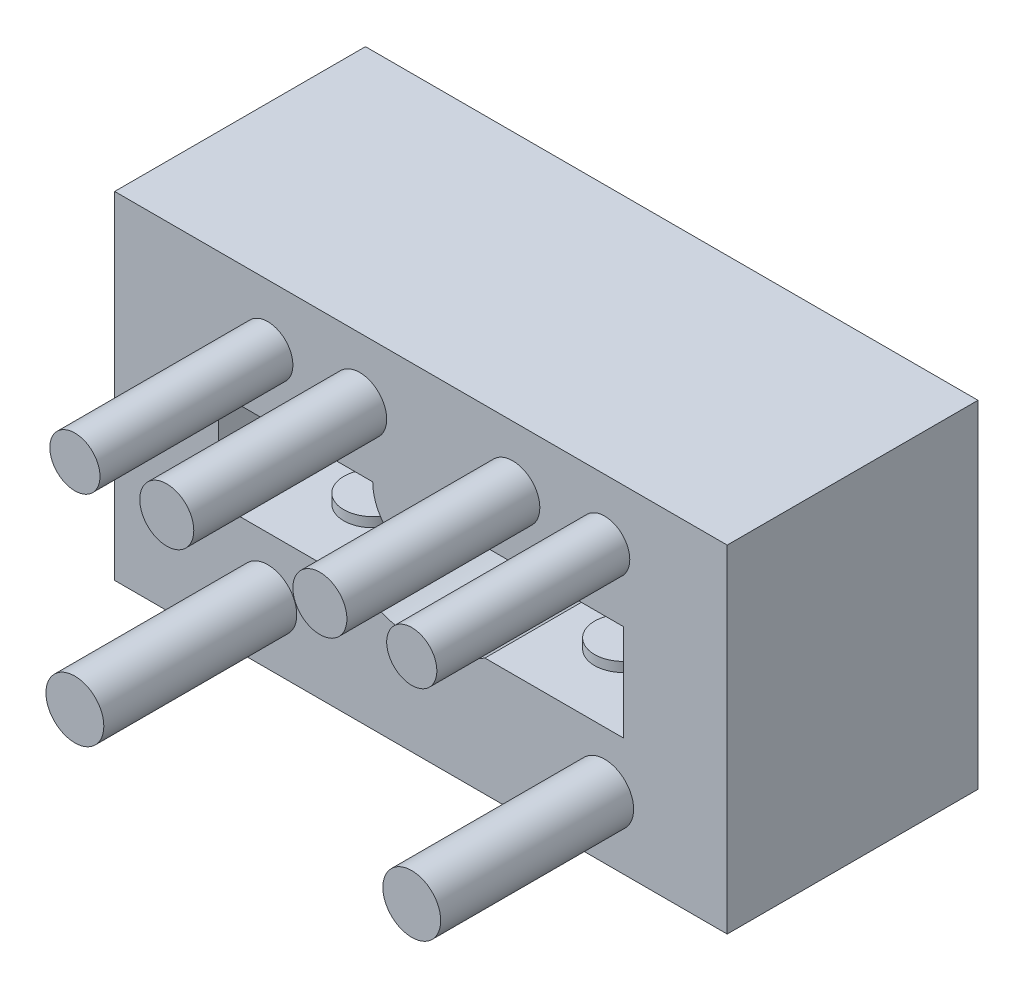
ISO-10303-21;
HEADER;
FILE_DESCRIPTION(('STEP AP214'),'2;1');
FILE_NAME('part.step','',(''),(''),'','','');
FILE_SCHEMA(('AUTOMOTIVE_DESIGN { 1 0 10303 214 1 1 1 1 }'));
ENDSEC;
DATA;
#1=APPLICATION_CONTEXT('core data for automotive mechanical design processes');
#2=APPLICATION_PROTOCOL_DEFINITION('international standard','automotive_design',2000,#1);
#3=PRODUCT_CONTEXT('',#1,'mechanical');
#4=PRODUCT('Part','Part','',(#3));
#5=PRODUCT_RELATED_PRODUCT_CATEGORY('part','',(#4));
#6=PRODUCT_DEFINITION_FORMATION('','',#4);
#7=PRODUCT_DEFINITION_CONTEXT('part definition',#1,'design');
#8=PRODUCT_DEFINITION('design','',#6,#7);
#9=PRODUCT_DEFINITION_SHAPE('','',#8);
#10=(LENGTH_UNIT() NAMED_UNIT(*) SI_UNIT(.MILLI.,.METRE.));
#11=(NAMED_UNIT(*) PLANE_ANGLE_UNIT() SI_UNIT($,.RADIAN.));
#12=(NAMED_UNIT(*) SI_UNIT($,.STERADIAN.) SOLID_ANGLE_UNIT());
#13=UNCERTAINTY_MEASURE_WITH_UNIT(LENGTH_MEASURE(1.E-05),#10,'distance_accuracy_value','');
#14=(GEOMETRIC_REPRESENTATION_CONTEXT(3) GLOBAL_UNCERTAINTY_ASSIGNED_CONTEXT((#13)) GLOBAL_UNIT_ASSIGNED_CONTEXT((#10,
#11,#12)) REPRESENTATION_CONTEXT('',''));
#15=CARTESIAN_POINT('',(0.,0.,0.));
#16=DIRECTION('',(0.,0.,1.));
#17=DIRECTION('',(1.,0.,0.));
#18=AXIS2_PLACEMENT_3D('',#15,#16,#17);
#19=CARTESIAN_POINT('',(3.3166247903554,-5.,13.));
#20=DIRECTION('',(0.,1.,0.));
#21=DIRECTION('',(0.,0.,1.));
#22=AXIS2_PLACEMENT_3D('',#19,#20,#21);
#23=PLANE('',#22);
#24=DIRECTION('',(1.,0.,0.));
#25=VECTOR('',#24,1.);
#26=CARTESIAN_POINT('',(3.3166247903554,-5.,5.));
#27=LINE('',#26,#25);
#28=CARTESIAN_POINT('',(3.3166247903554,-5.,5.));
#29=VERTEX_POINT('',#28);
#30=CARTESIAN_POINT('',(10.5,-5.,5.));
#31=VERTEX_POINT('',#30);
#32=EDGE_CURVE('E174',#29,#31,#27,.T.);
#33=ORIENTED_EDGE('',*,*,#32,.F.);
#34=DIRECTION('',(0.,0.,-1.));
#35=VECTOR('',#34,1.);
#36=CARTESIAN_POINT('',(3.3166247903554,-5.,13.));
#37=LINE('',#36,#35);
#38=CARTESIAN_POINT('',(3.3166247903554,-5.,13.));
#39=VERTEX_POINT('',#38);
#40=EDGE_CURVE('E11',#39,#29,#37,.T.);
#41=ORIENTED_EDGE('',*,*,#40,.F.);
#42=DIRECTION('',(1.,0.,0.));
#43=VECTOR('',#42,1.);
#44=CARTESIAN_POINT('',(3.3166247903554,-5.,13.));
#45=LINE('',#44,#43);
#46=CARTESIAN_POINT('',(10.5,-5.,13.));
#47=VERTEX_POINT('',#46);
#48=EDGE_CURVE('E155',#39,#47,#45,.T.);
#49=ORIENTED_EDGE('',*,*,#48,.T.);
#50=DIRECTION('',(0.,0.,-1.));
#51=VECTOR('',#50,1.);
#52=CARTESIAN_POINT('',(10.5,-5.,13.));
#53=LINE('',#52,#51);
#54=EDGE_CURVE('E39',#47,#31,#53,.T.);
#55=ORIENTED_EDGE('',*,*,#54,.T.);
#56=EDGE_LOOP('',(#33,#41,#49,#55));
#57=FACE_BOUND('',#56,.T.);
#58=CARTESIAN_POINT('',(6.5,-5.,9.));
#59=DIRECTION('',(0.,1.,0.));
#60=DIRECTION('',(0.,0.,1.));
#61=AXIS2_PLACEMENT_3D('',#58,#59,#60);
#62=CIRCLE('',#61,1.5);
#63=CARTESIAN_POINT('',(6.5,-5.,10.5));
#64=VERTEX_POINT('',#63);
#65=EDGE_CURVE('E517',#64,#64,#62,.T.);
#66=ORIENTED_EDGE('',*,*,#65,.F.);
#67=EDGE_LOOP('',(#66));
#68=FACE_BOUND('',#67,.T.);
#69=ADVANCED_FACE('F31',(#57,#68),#23,.T.);
#70=CARTESIAN_POINT('',(-3.3166247903554,-5.,13.));
#71=DIRECTION('',(0.,1.,0.));
#72=DIRECTION('',(0.,0.,1.));
#73=AXIS2_PLACEMENT_3D('',#70,#71,#72);
#74=PLANE('',#73);
#75=DIRECTION('',(1.,0.,0.));
#76=VECTOR('',#75,1.);
#77=CARTESIAN_POINT('',(-3.3166247903554,-5.,5.));
#78=LINE('',#77,#76);
#79=CARTESIAN_POINT('',(-10.5,-5.,5.));
#80=VERTEX_POINT('',#79);
#81=CARTESIAN_POINT('',(-3.3166247903554,-5.,5.));
#82=VERTEX_POINT('',#81);
#83=EDGE_CURVE('E156',#80,#82,#78,.T.);
#84=ORIENTED_EDGE('',*,*,#83,.F.);
#85=DIRECTION('',(0.,0.,-1.));
#86=VECTOR('',#85,1.);
#87=CARTESIAN_POINT('',(-10.5,-5.,13.));
#88=LINE('',#87,#86);
#89=CARTESIAN_POINT('',(-10.5,-5.,13.));
#90=VERTEX_POINT('',#89);
#91=EDGE_CURVE('E190',#90,#80,#88,.T.);
#92=ORIENTED_EDGE('',*,*,#91,.F.);
#93=DIRECTION('',(1.,0.,0.));
#94=VECTOR('',#93,1.);
#95=CARTESIAN_POINT('',(-3.3166247903554,-5.,13.));
#96=LINE('',#95,#94);
#97=CARTESIAN_POINT('',(-3.3166247903554,-5.,13.));
#98=VERTEX_POINT('',#97);
#99=EDGE_CURVE('E169',#90,#98,#96,.T.);
#100=ORIENTED_EDGE('',*,*,#99,.T.);
#101=DIRECTION('',(0.,0.,-1.));
#102=VECTOR('',#101,1.);
#103=CARTESIAN_POINT('',(-3.3166247903554,-5.,13.));
#104=LINE('',#103,#102);
#105=EDGE_CURVE('E171',#98,#82,#104,.T.);
#106=ORIENTED_EDGE('',*,*,#105,.T.);
#107=EDGE_LOOP('',(#84,#92,#100,#106));
#108=FACE_BOUND('',#107,.T.);
#109=CARTESIAN_POINT('',(-6.5,-5.,9.));
#110=DIRECTION('',(0.,1.,0.));
#111=DIRECTION('',(0.,0.,1.));
#112=AXIS2_PLACEMENT_3D('',#109,#110,#111);
#113=CIRCLE('',#112,1.5);
#114=CARTESIAN_POINT('',(-6.5,-5.,10.5));
#115=VERTEX_POINT('',#114);
#116=EDGE_CURVE('E516',#115,#115,#113,.T.);
#117=ORIENTED_EDGE('',*,*,#116,.F.);
#118=EDGE_LOOP('',(#117));
#119=FACE_BOUND('',#118,.T.);
#120=ADVANCED_FACE('F226',(#108,#119),#74,.T.);
#121=CARTESIAN_POINT('',(0.,0.,13.));
#122=DIRECTION('',(0.,0.,1.));
#123=DIRECTION('',(1.,0.,0.));
#124=AXIS2_PLACEMENT_3D('',#121,#122,#123);
#125=PLANE('',#124);
#126=CARTESIAN_POINT('',(-3.175,3.175,13.));
#127=DIRECTION('',(0.,0.,1.));
#128=DIRECTION('',(1.,0.,0.));
#129=AXIS2_PLACEMENT_3D('',#126,#127,#128);
#130=CIRCLE('',#129,1.4);
#131=CARTESIAN_POINT('',(-1.775,3.175,13.));
#132=VERTEX_POINT('',#131);
#133=EDGE_CURVE('E273',#132,#132,#130,.T.);
#134=ORIENTED_EDGE('',*,*,#133,.F.);
#135=EDGE_LOOP('',(#134));
#136=FACE_BOUND('',#135,.T.);
#137=CARTESIAN_POINT('',(-7.9375,-7.9375,13.));
#138=DIRECTION('',(0.,0.,1.));
#139=DIRECTION('',(1.,0.,0.));
#140=AXIS2_PLACEMENT_3D('',#137,#138,#139);
#141=CIRCLE('',#140,1.5);
#142=CARTESIAN_POINT('',(-6.4375,-7.9375,13.));
#143=VERTEX_POINT('',#142);
#144=EDGE_CURVE('E277',#143,#143,#141,.T.);
#145=ORIENTED_EDGE('',*,*,#144,.F.);
#146=EDGE_LOOP('',(#145));
#147=FACE_BOUND('',#146,.T.);
#148=CARTESIAN_POINT('',(9.525,3.175,13.));
#149=DIRECTION('',(0.,0.,1.));
#150=DIRECTION('',(1.,0.,0.));
#151=AXIS2_PLACEMENT_3D('',#148,#149,#150);
#152=CIRCLE('',#151,1.3);
#153=CARTESIAN_POINT('',(10.825,3.175,13.));
#154=VERTEX_POINT('',#153);
#155=EDGE_CURVE('E280',#154,#154,#152,.T.);
#156=ORIENTED_EDGE('',*,*,#155,.F.);
#157=EDGE_LOOP('',(#156));
#158=FACE_BOUND('',#157,.T.);
#159=ORIENTED_EDGE('',*,*,#48,.F.);
#160=CARTESIAN_POINT('',(0.,0.,13.));
#161=DIRECTION('',(0.,0.,1.));
#162=DIRECTION('',(-1.,0.,0.));
#163=AXIS2_PLACEMENT_3D('',#160,#161,#162);
#164=CIRCLE('',#163,6.);
#165=EDGE_CURVE('E153',#98,#39,#164,.T.);
#166=ORIENTED_EDGE('',*,*,#165,.F.);
#167=ORIENTED_EDGE('',*,*,#99,.F.);
#168=DIRECTION('',(0.,-1.,0.));
#169=VECTOR('',#168,1.);
#170=CARTESIAN_POINT('',(-10.5,-5.,13.));
#171=LINE('',#170,#169);
#172=CARTESIAN_POINT('',(-10.5,0.,13.));
#173=VERTEX_POINT('',#172);
#174=EDGE_CURVE('E166',#173,#90,#171,.T.);
#175=ORIENTED_EDGE('',*,*,#174,.F.);
#176=DIRECTION('',(-1.,0.,0.));
#177=VECTOR('',#176,1.);
#178=CARTESIAN_POINT('',(-2.5,0.,13.));
#179=LINE('',#178,#177);
#180=CARTESIAN_POINT('',(-2.5,0.,13.));
#181=VERTEX_POINT('',#180);
#182=EDGE_CURVE('E164',#181,#173,#179,.T.);
#183=ORIENTED_EDGE('',*,*,#182,.F.);
#184=CARTESIAN_POINT('',(0.,0.,13.));
#185=DIRECTION('',(0.,0.,-1.));
#186=DIRECTION('',(-1.,0.,0.));
#187=AXIS2_PLACEMENT_3D('',#184,#185,#186);
#188=CIRCLE('',#187,2.5);
#189=CARTESIAN_POINT('',(2.5,0.,13.));
#190=VERTEX_POINT('',#189);
#191=EDGE_CURVE('E162',#190,#181,#188,.T.);
#192=ORIENTED_EDGE('',*,*,#191,.F.);
#193=DIRECTION('',(-1.,0.,0.));
#194=VECTOR('',#193,1.);
#195=CARTESIAN_POINT('',(2.5,0.,13.));
#196=LINE('',#195,#194);
#197=CARTESIAN_POINT('',(10.5,0.,13.));
#198=VERTEX_POINT('',#197);
#199=EDGE_CURVE('E160',#198,#190,#196,.T.);
#200=ORIENTED_EDGE('',*,*,#199,.F.);
#201=DIRECTION('',(0.,1.,0.));
#202=VECTOR('',#201,1.);
#203=CARTESIAN_POINT('',(10.5,0.,13.));
#204=LINE('',#203,#202);
#205=EDGE_CURVE('E158',#47,#198,#204,.T.);
#206=ORIENTED_EDGE('',*,*,#205,.F.);
#207=EDGE_LOOP('',(#159,#166,#167,#175,#183,#192,#200,#206));
#208=FACE_BOUND('',#207,.T.);
#209=DIRECTION('',(0.,-1.,0.));
#210=VECTOR('',#209,1.);
#211=CARTESIAN_POINT('',(-15.875,-11.1125,13.));
#212=LINE('',#211,#210);
#213=CARTESIAN_POINT('',(-15.875,6.35,13.));
#214=VERTEX_POINT('',#213);
#215=CARTESIAN_POINT('',(-15.875,-11.1125,13.));
#216=VERTEX_POINT('',#215);
#217=EDGE_CURVE('E141',#214,#216,#212,.T.);
#218=ORIENTED_EDGE('',*,*,#217,.T.);
#219=DIRECTION('',(1.,0.,0.));
#220=VECTOR('',#219,1.);
#221=CARTESIAN_POINT('',(15.875,-11.1125,13.));
#222=LINE('',#221,#220);
#223=CARTESIAN_POINT('',(15.875,-11.1125,13.));
#224=VERTEX_POINT('',#223);
#225=EDGE_CURVE('E54',#216,#224,#222,.T.);
#226=ORIENTED_EDGE('',*,*,#225,.T.);
#227=DIRECTION('',(0.,1.,0.));
#228=VECTOR('',#227,1.);
#229=CARTESIAN_POINT('',(15.875,6.35,13.));
#230=LINE('',#229,#228);
#231=CARTESIAN_POINT('',(15.875,6.35,13.));
#232=VERTEX_POINT('',#231);
#233=EDGE_CURVE('E130',#224,#232,#230,.T.);
#234=ORIENTED_EDGE('',*,*,#233,.T.);
#235=DIRECTION('',(-1.,0.,0.));
#236=VECTOR('',#235,1.);
#237=CARTESIAN_POINT('',(-15.875,6.35,13.));
#238=LINE('',#237,#236);
#239=EDGE_CURVE('E136',#232,#214,#238,.T.);
#240=ORIENTED_EDGE('',*,*,#239,.T.);
#241=EDGE_LOOP('',(#218,#226,#234,#240));
#242=FACE_BOUND('',#241,.T.);
#243=CARTESIAN_POINT('',(-7.9375,3.175,13.));
#244=DIRECTION('',(0.,0.,1.));
#245=DIRECTION('',(1.,0.,0.));
#246=AXIS2_PLACEMENT_3D('',#243,#244,#245);
#247=CIRCLE('',#246,1.3);
#248=CARTESIAN_POINT('',(-6.6375,3.175,13.));
#249=VERTEX_POINT('',#248);
#250=EDGE_CURVE('E287',#249,#249,#247,.T.);
#251=ORIENTED_EDGE('',*,*,#250,.F.);
#252=EDGE_LOOP('',(#251));
#253=FACE_BOUND('',#252,.T.);
#254=CARTESIAN_POINT('',(9.525,-7.9375,13.));
#255=DIRECTION('',(0.,0.,1.));
#256=DIRECTION('',(1.,0.,0.));
#257=AXIS2_PLACEMENT_3D('',#254,#255,#256);
#258=CIRCLE('',#257,1.5);
#259=CARTESIAN_POINT('',(11.025,-7.9375,13.));
#260=VERTEX_POINT('',#259);
#261=EDGE_CURVE('E536',#260,#260,#258,.T.);
#262=ORIENTED_EDGE('',*,*,#261,.F.);
#263=EDGE_LOOP('',(#262));
#264=FACE_BOUND('',#263,.T.);
#265=CARTESIAN_POINT('',(4.7625,3.175,13.));
#266=DIRECTION('',(0.,0.,1.));
#267=DIRECTION('',(1.,0.,0.));
#268=AXIS2_PLACEMENT_3D('',#265,#266,#267);
#269=CIRCLE('',#268,1.4);
#270=CARTESIAN_POINT('',(6.1625,3.175,13.));
#271=VERTEX_POINT('',#270);
#272=EDGE_CURVE('E526',#271,#271,#269,.T.);
#273=ORIENTED_EDGE('',*,*,#272,.F.);
#274=EDGE_LOOP('',(#273));
#275=FACE_BOUND('',#274,.T.);
#276=ADVANCED_FACE('F139',(#136,#147,#158,#208,#242,#253,#264,#275),#125,.T.);
#277=CARTESIAN_POINT('',(0.,0.,13.));
#278=DIRECTION('',(0.,0.,-1.));
#279=DIRECTION('',(-1.,0.,0.));
#280=AXIS2_PLACEMENT_3D('',#277,#278,#279);
#281=CYLINDRICAL_SURFACE('',#280,6.);
#282=CARTESIAN_POINT('',(0.,0.,5.));
#283=DIRECTION('',(0.,0.,1.));
#284=DIRECTION('',(-1.,0.,0.));
#285=AXIS2_PLACEMENT_3D('',#282,#283,#284);
#286=CIRCLE('',#285,6.);
#287=EDGE_CURVE('E172',#82,#29,#286,.T.);
#288=ORIENTED_EDGE('',*,*,#287,.F.);
#289=ORIENTED_EDGE('',*,*,#105,.F.);
#290=ORIENTED_EDGE('',*,*,#165,.T.);
#291=ORIENTED_EDGE('',*,*,#40,.T.);
#292=EDGE_LOOP('',(#288,#289,#290,#291));
#293=FACE_BOUND('',#292,.T.);
#294=ADVANCED_FACE('F223',(#293),#281,.F.);
#295=CARTESIAN_POINT('',(10.5,0.,13.));
#296=DIRECTION('',(-1.,0.,0.));
#297=DIRECTION('',(0.,0.,1.));
#298=AXIS2_PLACEMENT_3D('',#295,#296,#297);
#299=PLANE('',#298);
#300=DIRECTION('',(0.,1.,0.));
#301=VECTOR('',#300,1.);
#302=CARTESIAN_POINT('',(10.5,0.,5.));
#303=LINE('',#302,#301);
#304=CARTESIAN_POINT('',(10.5,0.,5.));
#305=VERTEX_POINT('',#304);
#306=EDGE_CURVE('E177',#31,#305,#303,.T.);
#307=ORIENTED_EDGE('',*,*,#306,.F.);
#308=ORIENTED_EDGE('',*,*,#54,.F.);
#309=ORIENTED_EDGE('',*,*,#205,.T.);
#310=DIRECTION('',(0.,0.,-1.));
#311=VECTOR('',#310,1.);
#312=CARTESIAN_POINT('',(10.5,0.,13.));
#313=LINE('',#312,#311);
#314=EDGE_CURVE('E202',#198,#305,#313,.T.);
#315=ORIENTED_EDGE('',*,*,#314,.T.);
#316=EDGE_LOOP('',(#307,#308,#309,#315));
#317=FACE_BOUND('',#316,.T.);
#318=ADVANCED_FACE('F214',(#317),#299,.T.);
#319=CARTESIAN_POINT('',(2.5,0.,13.));
#320=DIRECTION('',(0.,-1.,0.));
#321=DIRECTION('',(0.,0.,-1.));
#322=AXIS2_PLACEMENT_3D('',#319,#320,#321);
#323=PLANE('',#322);
#324=DIRECTION('',(-1.,0.,0.));
#325=VECTOR('',#324,1.);
#326=CARTESIAN_POINT('',(2.5,0.,5.));
#327=LINE('',#326,#325);
#328=CARTESIAN_POINT('',(2.5,0.,5.));
#329=VERTEX_POINT('',#328);
#330=EDGE_CURVE('E179',#305,#329,#327,.T.);
#331=ORIENTED_EDGE('',*,*,#330,.F.);
#332=ORIENTED_EDGE('',*,*,#314,.F.);
#333=ORIENTED_EDGE('',*,*,#199,.T.);
#334=DIRECTION('',(0.,0.,-1.));
#335=VECTOR('',#334,1.);
#336=CARTESIAN_POINT('',(2.5,0.,13.));
#337=LINE('',#336,#335);
#338=EDGE_CURVE('E199',#190,#329,#337,.T.);
#339=ORIENTED_EDGE('',*,*,#338,.T.);
#340=EDGE_LOOP('',(#331,#332,#333,#339));
#341=FACE_BOUND('',#340,.T.);
#342=ADVANCED_FACE('F235',(#341),#323,.T.);
#343=CARTESIAN_POINT('',(0.,0.,13.));
#344=DIRECTION('',(0.,0.,-1.));
#345=DIRECTION('',(-1.,0.,0.));
#346=AXIS2_PLACEMENT_3D('',#343,#344,#345);
#347=CYLINDRICAL_SURFACE('',#346,2.5);
#348=CARTESIAN_POINT('',(0.,0.,5.));
#349=DIRECTION('',(0.,0.,-1.));
#350=DIRECTION('',(-1.,0.,0.));
#351=AXIS2_PLACEMENT_3D('',#348,#349,#350);
#352=CIRCLE('',#351,2.5);
#353=CARTESIAN_POINT('',(-2.5,0.,5.));
#354=VERTEX_POINT('',#353);
#355=EDGE_CURVE('E181',#329,#354,#352,.T.);
#356=ORIENTED_EDGE('',*,*,#355,.F.);
#357=ORIENTED_EDGE('',*,*,#338,.F.);
#358=ORIENTED_EDGE('',*,*,#191,.T.);
#359=DIRECTION('',(0.,0.,-1.));
#360=VECTOR('',#359,1.);
#361=CARTESIAN_POINT('',(-2.5,0.,13.));
#362=LINE('',#361,#360);
#363=EDGE_CURVE('E196',#181,#354,#362,.T.);
#364=ORIENTED_EDGE('',*,*,#363,.T.);
#365=EDGE_LOOP('',(#356,#357,#358,#364));
#366=FACE_BOUND('',#365,.T.);
#367=ADVANCED_FACE('F239',(#366),#347,.T.);
#368=CARTESIAN_POINT('',(-2.5,0.,13.));
#369=DIRECTION('',(0.,-1.,0.));
#370=DIRECTION('',(1.,0.,0.));
#371=AXIS2_PLACEMENT_3D('',#368,#369,#370);
#372=PLANE('',#371);
#373=DIRECTION('',(-1.,0.,0.));
#374=VECTOR('',#373,1.);
#375=CARTESIAN_POINT('',(-2.5,0.,5.));
#376=LINE('',#375,#374);
#377=CARTESIAN_POINT('',(-10.5,0.,5.));
#378=VERTEX_POINT('',#377);
#379=EDGE_CURVE('E183',#354,#378,#376,.T.);
#380=ORIENTED_EDGE('',*,*,#379,.F.);
#381=ORIENTED_EDGE('',*,*,#363,.F.);
#382=ORIENTED_EDGE('',*,*,#182,.T.);
#383=DIRECTION('',(0.,0.,-1.));
#384=VECTOR('',#383,1.);
#385=CARTESIAN_POINT('',(-10.5,0.,13.));
#386=LINE('',#385,#384);
#387=EDGE_CURVE('E193',#173,#378,#386,.T.);
#388=ORIENTED_EDGE('',*,*,#387,.T.);
#389=EDGE_LOOP('',(#380,#381,#382,#388));
#390=FACE_BOUND('',#389,.T.);
#391=ADVANCED_FACE('F245',(#390),#372,.T.);
#392=CARTESIAN_POINT('',(-10.5,-5.,13.));
#393=DIRECTION('',(1.,0.,0.));
#394=DIRECTION('',(0.,0.,-1.));
#395=AXIS2_PLACEMENT_3D('',#392,#393,#394);
#396=PLANE('',#395);
#397=DIRECTION('',(0.,-1.,0.));
#398=VECTOR('',#397,1.);
#399=CARTESIAN_POINT('',(-10.5,-5.,5.));
#400=LINE('',#399,#398);
#401=EDGE_CURVE('E185',#378,#80,#400,.T.);
#402=ORIENTED_EDGE('',*,*,#401,.F.);
#403=ORIENTED_EDGE('',*,*,#387,.F.);
#404=ORIENTED_EDGE('',*,*,#174,.T.);
#405=ORIENTED_EDGE('',*,*,#91,.T.);
#406=EDGE_LOOP('',(#402,#403,#404,#405));
#407=FACE_BOUND('',#406,.T.);
#408=ADVANCED_FACE('F247',(#407),#396,.T.);
#409=CARTESIAN_POINT('',(0.,0.,5.));
#410=DIRECTION('',(0.,0.,1.));
#411=DIRECTION('',(1.,0.,0.));
#412=AXIS2_PLACEMENT_3D('',#409,#410,#411);
#413=PLANE('',#412);
#414=ORIENTED_EDGE('',*,*,#287,.T.);
#415=ORIENTED_EDGE('',*,*,#32,.T.);
#416=ORIENTED_EDGE('',*,*,#306,.T.);
#417=ORIENTED_EDGE('',*,*,#330,.T.);
#418=ORIENTED_EDGE('',*,*,#355,.T.);
#419=ORIENTED_EDGE('',*,*,#379,.T.);
#420=ORIENTED_EDGE('',*,*,#401,.T.);
#421=ORIENTED_EDGE('',*,*,#83,.T.);
#422=EDGE_LOOP('',(#414,#415,#416,#417,#418,#419,#420,#421));
#423=FACE_BOUND('',#422,.T.);
#424=ADVANCED_FACE('F218',(#423),#413,.T.);
#425=CARTESIAN_POINT('',(15.875,-11.1125,-67.8822509939086));
#426=DIRECTION('',(0.,-1.,0.));
#427=DIRECTION('',(1.,0.,0.));
#428=AXIS2_PLACEMENT_3D('',#425,#426,#427);
#429=PLANE('',#428);
#430=DIRECTION('',(0.,0.,1.));
#431=VECTOR('',#430,1.);
#432=CARTESIAN_POINT('',(15.875,-11.1125,-67.8822509939086));
#433=LINE('',#432,#431);
#434=CARTESIAN_POINT('',(15.875,-11.1125,0.));
#435=VERTEX_POINT('',#434);
#436=EDGE_CURVE('E119',#435,#224,#433,.T.);
#437=ORIENTED_EDGE('',*,*,#436,.T.);
#438=ORIENTED_EDGE('',*,*,#225,.F.);
#439=DIRECTION('',(0.,0.,1.));
#440=VECTOR('',#439,1.);
#441=CARTESIAN_POINT('',(-15.875,-11.1125,-67.8822509939086));
#442=LINE('',#441,#440);
#443=CARTESIAN_POINT('',(-15.875,-11.1125,0.));
#444=VERTEX_POINT('',#443);
#445=EDGE_CURVE('E127',#444,#216,#442,.T.);
#446=ORIENTED_EDGE('',*,*,#445,.F.);
#447=DIRECTION('',(-1.,0.,0.));
#448=VECTOR('',#447,1.);
#449=CARTESIAN_POINT('',(15.875,-11.1125,0.));
#450=LINE('',#449,#448);
#451=EDGE_CURVE('E123',#435,#444,#450,.T.);
#452=ORIENTED_EDGE('',*,*,#451,.F.);
#453=EDGE_LOOP('',(#437,#438,#446,#452));
#454=FACE_BOUND('',#453,.T.);
#455=ADVANCED_FACE('F121',(#454),#429,.T.);
#456=CARTESIAN_POINT('',(15.875,6.35,-67.8822509939086));
#457=DIRECTION('',(1.,0.,0.));
#458=DIRECTION('',(0.,0.,-1.));
#459=AXIS2_PLACEMENT_3D('',#456,#457,#458);
#460=PLANE('',#459);
#461=DIRECTION('',(0.,0.,1.));
#462=VECTOR('',#461,1.);
#463=CARTESIAN_POINT('',(15.875,6.35,-67.8822509939086));
#464=LINE('',#463,#462);
#465=CARTESIAN_POINT('',(15.875,6.35,0.));
#466=VERTEX_POINT('',#465);
#467=EDGE_CURVE('E126',#466,#232,#464,.T.);
#468=ORIENTED_EDGE('',*,*,#467,.T.);
#469=ORIENTED_EDGE('',*,*,#233,.F.);
#470=ORIENTED_EDGE('',*,*,#436,.F.);
#471=DIRECTION('',(0.,-1.,0.));
#472=VECTOR('',#471,1.);
#473=CARTESIAN_POINT('',(15.875,6.35,0.));
#474=LINE('',#473,#472);
#475=EDGE_CURVE('E175',#466,#435,#474,.T.);
#476=ORIENTED_EDGE('',*,*,#475,.F.);
#477=EDGE_LOOP('',(#468,#469,#470,#476));
#478=FACE_BOUND('',#477,.T.);
#479=ADVANCED_FACE('F131',(#478),#460,.T.);
#480=CARTESIAN_POINT('',(-15.875,6.35,-67.8822509939086));
#481=DIRECTION('',(0.,1.,0.));
#482=DIRECTION('',(0.,0.,1.));
#483=AXIS2_PLACEMENT_3D('',#480,#481,#482);
#484=PLANE('',#483);
#485=DIRECTION('',(0.,0.,1.));
#486=VECTOR('',#485,1.);
#487=CARTESIAN_POINT('',(-15.875,6.35,-67.8822509939086));
#488=LINE('',#487,#486);
#489=CARTESIAN_POINT('',(-15.875,6.35,0.));
#490=VERTEX_POINT('',#489);
#491=EDGE_CURVE('E46',#490,#214,#488,.T.);
#492=ORIENTED_EDGE('',*,*,#491,.T.);
#493=ORIENTED_EDGE('',*,*,#239,.F.);
#494=ORIENTED_EDGE('',*,*,#467,.F.);
#495=DIRECTION('',(1.,0.,0.));
#496=VECTOR('',#495,1.);
#497=CARTESIAN_POINT('',(-15.875,6.35,0.));
#498=LINE('',#497,#496);
#499=EDGE_CURVE('E292',#490,#466,#498,.T.);
#500=ORIENTED_EDGE('',*,*,#499,.F.);
#501=EDGE_LOOP('',(#492,#493,#494,#500));
#502=FACE_BOUND('',#501,.T.);
#503=ADVANCED_FACE('F298',(#502),#484,.T.);
#504=CARTESIAN_POINT('',(-15.875,-11.1125,-67.8822509939086));
#505=DIRECTION('',(-1.,0.,0.));
#506=DIRECTION('',(0.,0.,1.));
#507=AXIS2_PLACEMENT_3D('',#504,#505,#506);
#508=PLANE('',#507);
#509=ORIENTED_EDGE('',*,*,#445,.T.);
#510=ORIENTED_EDGE('',*,*,#217,.F.);
#511=ORIENTED_EDGE('',*,*,#491,.F.);
#512=DIRECTION('',(0.,1.,0.));
#513=VECTOR('',#512,1.);
#514=CARTESIAN_POINT('',(-15.875,-11.1125,0.));
#515=LINE('',#514,#513);
#516=EDGE_CURVE('E152',#444,#490,#515,.T.);
#517=ORIENTED_EDGE('',*,*,#516,.F.);
#518=EDGE_LOOP('',(#509,#510,#511,#517));
#519=FACE_BOUND('',#518,.T.);
#520=ADVANCED_FACE('F296',(#519),#508,.T.);
#521=CARTESIAN_POINT('',(0.,0.,0.));
#522=DIRECTION('',(0.,0.,1.));
#523=DIRECTION('',(1.,0.,0.));
#524=AXIS2_PLACEMENT_3D('',#521,#522,#523);
#525=PLANE('',#524);
#526=ORIENTED_EDGE('',*,*,#451,.T.);
#527=ORIENTED_EDGE('',*,*,#516,.T.);
#528=ORIENTED_EDGE('',*,*,#499,.T.);
#529=ORIENTED_EDGE('',*,*,#475,.T.);
#530=EDGE_LOOP('',(#526,#527,#528,#529));
#531=FACE_BOUND('',#530,.T.);
#532=ADVANCED_FACE('F33',(#531),#525,.F.);
#533=CARTESIAN_POINT('',(9.525,3.175,23.));
#534=DIRECTION('',(0.,0.,-1.));
#535=DIRECTION('',(-1.,0.,0.));
#536=AXIS2_PLACEMENT_3D('',#533,#534,#535);
#537=CYLINDRICAL_SURFACE('',#536,1.3);
#538=CARTESIAN_POINT('',(9.525,3.175,23.));
#539=DIRECTION('',(0.,0.,1.));
#540=DIRECTION('',(1.,0.,0.));
#541=AXIS2_PLACEMENT_3D('',#538,#539,#540);
#542=CIRCLE('',#541,1.3);
#543=CARTESIAN_POINT('',(10.825,3.175,23.));
#544=VERTEX_POINT('',#543);
#545=EDGE_CURVE('E143',#544,#544,#542,.T.);
#546=ORIENTED_EDGE('',*,*,#545,.F.);
#547=EDGE_LOOP('',(#546));
#548=FACE_BOUND('',#547,.T.);
#549=ORIENTED_EDGE('',*,*,#155,.T.);
#550=EDGE_LOOP('',(#549));
#551=FACE_BOUND('',#550,.T.);
#552=ADVANCED_FACE('F308',(#548,#551),#537,.T.);
#553=CARTESIAN_POINT('',(9.525,3.175,23.));
#554=DIRECTION('',(0.,0.,1.));
#555=DIRECTION('',(1.,0.,0.));
#556=AXIS2_PLACEMENT_3D('',#553,#554,#555);
#557=PLANE('',#556);
#558=ORIENTED_EDGE('',*,*,#545,.T.);
#559=EDGE_LOOP('',(#558));
#560=FACE_BOUND('',#559,.T.);
#561=ADVANCED_FACE('F351',(#560),#557,.T.);
#562=CARTESIAN_POINT('',(-7.9375,3.175,23.));
#563=DIRECTION('',(0.,0.,-1.));
#564=DIRECTION('',(-1.,0.,0.));
#565=AXIS2_PLACEMENT_3D('',#562,#563,#564);
#566=CYLINDRICAL_SURFACE('',#565,1.3);
#567=CARTESIAN_POINT('',(-7.9375,3.175,23.));
#568=DIRECTION('',(0.,0.,1.));
#569=DIRECTION('',(1.,0.,0.));
#570=AXIS2_PLACEMENT_3D('',#567,#568,#569);
#571=CIRCLE('',#570,1.3);
#572=CARTESIAN_POINT('',(-6.6375,3.175,23.));
#573=VERTEX_POINT('',#572);
#574=EDGE_CURVE('E282',#573,#573,#571,.T.);
#575=ORIENTED_EDGE('',*,*,#574,.F.);
#576=EDGE_LOOP('',(#575));
#577=FACE_BOUND('',#576,.T.);
#578=ORIENTED_EDGE('',*,*,#250,.T.);
#579=EDGE_LOOP('',(#578));
#580=FACE_BOUND('',#579,.T.);
#581=ADVANCED_FACE('F360',(#577,#580),#566,.T.);
#582=CARTESIAN_POINT('',(-7.9375,3.175,23.));
#583=DIRECTION('',(0.,0.,1.));
#584=DIRECTION('',(1.,0.,0.));
#585=AXIS2_PLACEMENT_3D('',#582,#583,#584);
#586=PLANE('',#585);
#587=ORIENTED_EDGE('',*,*,#574,.T.);
#588=EDGE_LOOP('',(#587));
#589=FACE_BOUND('',#588,.T.);
#590=ADVANCED_FACE('F369',(#589),#586,.T.);
#591=CARTESIAN_POINT('',(-7.9375,-7.9375,23.));
#592=DIRECTION('',(0.,0.,-1.));
#593=DIRECTION('',(-1.,0.,0.));
#594=AXIS2_PLACEMENT_3D('',#591,#592,#593);
#595=CYLINDRICAL_SURFACE('',#594,1.5);
#596=CARTESIAN_POINT('',(-7.9375,-7.9375,23.));
#597=DIRECTION('',(0.,0.,1.));
#598=DIRECTION('',(1.,0.,0.));
#599=AXIS2_PLACEMENT_3D('',#596,#597,#598);
#600=CIRCLE('',#599,1.5);
#601=CARTESIAN_POINT('',(-6.4375,-7.9375,23.));
#602=VERTEX_POINT('',#601);
#603=EDGE_CURVE('E543',#602,#602,#600,.T.);
#604=ORIENTED_EDGE('',*,*,#603,.F.);
#605=EDGE_LOOP('',(#604));
#606=FACE_BOUND('',#605,.T.);
#607=ORIENTED_EDGE('',*,*,#144,.T.);
#608=EDGE_LOOP('',(#607));
#609=FACE_BOUND('',#608,.T.);
#610=ADVANCED_FACE('F379',(#606,#609),#595,.T.);
#611=CARTESIAN_POINT('',(-7.9375,-7.9375,23.));
#612=DIRECTION('',(0.,0.,1.));
#613=DIRECTION('',(1.,0.,0.));
#614=AXIS2_PLACEMENT_3D('',#611,#612,#613);
#615=PLANE('',#614);
#616=ORIENTED_EDGE('',*,*,#603,.T.);
#617=EDGE_LOOP('',(#616));
#618=FACE_BOUND('',#617,.T.);
#619=ADVANCED_FACE('F389',(#618),#615,.T.);
#620=CARTESIAN_POINT('',(9.525,-7.9375,23.));
#621=DIRECTION('',(0.,0.,-1.));
#622=DIRECTION('',(-1.,0.,0.));
#623=AXIS2_PLACEMENT_3D('',#620,#621,#622);
#624=CYLINDRICAL_SURFACE('',#623,1.5);
#625=CARTESIAN_POINT('',(9.525,-7.9375,23.));
#626=DIRECTION('',(0.,0.,1.));
#627=DIRECTION('',(1.,0.,0.));
#628=AXIS2_PLACEMENT_3D('',#625,#626,#627);
#629=CIRCLE('',#628,1.5);
#630=CARTESIAN_POINT('',(11.025,-7.9375,23.));
#631=VERTEX_POINT('',#630);
#632=EDGE_CURVE('E538',#631,#631,#629,.T.);
#633=ORIENTED_EDGE('',*,*,#632,.F.);
#634=EDGE_LOOP('',(#633));
#635=FACE_BOUND('',#634,.T.);
#636=ORIENTED_EDGE('',*,*,#261,.T.);
#637=EDGE_LOOP('',(#636));
#638=FACE_BOUND('',#637,.T.);
#639=ADVANCED_FACE('F399',(#635,#638),#624,.T.);
#640=CARTESIAN_POINT('',(9.525,-7.9375,23.));
#641=DIRECTION('',(0.,0.,1.));
#642=DIRECTION('',(1.,0.,0.));
#643=AXIS2_PLACEMENT_3D('',#640,#641,#642);
#644=PLANE('',#643);
#645=ORIENTED_EDGE('',*,*,#632,.T.);
#646=EDGE_LOOP('',(#645));
#647=FACE_BOUND('',#646,.T.);
#648=ADVANCED_FACE('F409',(#647),#644,.T.);
#649=CARTESIAN_POINT('',(-3.175,3.175,23.));
#650=DIRECTION('',(0.,0.,-1.));
#651=DIRECTION('',(-1.,0.,0.));
#652=AXIS2_PLACEMENT_3D('',#649,#650,#651);
#653=CYLINDRICAL_SURFACE('',#652,1.4);
#654=CARTESIAN_POINT('',(-3.175,3.175,23.));
#655=DIRECTION('',(0.,0.,1.));
#656=DIRECTION('',(1.,0.,0.));
#657=AXIS2_PLACEMENT_3D('',#654,#655,#656);
#658=CIRCLE('',#657,1.4);
#659=CARTESIAN_POINT('',(-1.775,3.175,23.));
#660=VERTEX_POINT('',#659);
#661=EDGE_CURVE('E533',#660,#660,#658,.T.);
#662=ORIENTED_EDGE('',*,*,#661,.F.);
#663=EDGE_LOOP('',(#662));
#664=FACE_BOUND('',#663,.T.);
#665=ORIENTED_EDGE('',*,*,#133,.T.);
#666=EDGE_LOOP('',(#665));
#667=FACE_BOUND('',#666,.T.);
#668=ADVANCED_FACE('F419',(#664,#667),#653,.T.);
#669=CARTESIAN_POINT('',(-3.175,3.175,23.));
#670=DIRECTION('',(0.,0.,1.));
#671=DIRECTION('',(1.,0.,0.));
#672=AXIS2_PLACEMENT_3D('',#669,#670,#671);
#673=PLANE('',#672);
#674=ORIENTED_EDGE('',*,*,#661,.T.);
#675=EDGE_LOOP('',(#674));
#676=FACE_BOUND('',#675,.T.);
#677=ADVANCED_FACE('F429',(#676),#673,.T.);
#678=CARTESIAN_POINT('',(4.7625,3.175,23.));
#679=DIRECTION('',(0.,0.,-1.));
#680=DIRECTION('',(-1.,0.,0.));
#681=AXIS2_PLACEMENT_3D('',#678,#679,#680);
#682=CYLINDRICAL_SURFACE('',#681,1.4);
#683=CARTESIAN_POINT('',(4.7625,3.175,23.));
#684=DIRECTION('',(0.,0.,1.));
#685=DIRECTION('',(1.,0.,0.));
#686=AXIS2_PLACEMENT_3D('',#683,#684,#685);
#687=CIRCLE('',#686,1.4);
#688=CARTESIAN_POINT('',(6.1625,3.175,23.));
#689=VERTEX_POINT('',#688);
#690=EDGE_CURVE('E528',#689,#689,#687,.T.);
#691=ORIENTED_EDGE('',*,*,#690,.F.);
#692=EDGE_LOOP('',(#691));
#693=FACE_BOUND('',#692,.T.);
#694=ORIENTED_EDGE('',*,*,#272,.T.);
#695=EDGE_LOOP('',(#694));
#696=FACE_BOUND('',#695,.T.);
#697=ADVANCED_FACE('F439',(#693,#696),#682,.T.);
#698=CARTESIAN_POINT('',(4.7625,3.175,23.));
#699=DIRECTION('',(0.,0.,1.));
#700=DIRECTION('',(1.,0.,0.));
#701=AXIS2_PLACEMENT_3D('',#698,#699,#700);
#702=PLANE('',#701);
#703=ORIENTED_EDGE('',*,*,#690,.T.);
#704=EDGE_LOOP('',(#703));
#705=FACE_BOUND('',#704,.T.);
#706=ADVANCED_FACE('F449',(#705),#702,.T.);
#707=CARTESIAN_POINT('',(-6.5,-4.5,9.));
#708=DIRECTION('',(0.,-1.,0.));
#709=DIRECTION('',(0.,0.,-1.));
#710=AXIS2_PLACEMENT_3D('',#707,#708,#709);
#711=CYLINDRICAL_SURFACE('',#710,1.5);
#712=CARTESIAN_POINT('',(-6.5,-4.5,9.));
#713=DIRECTION('',(0.,1.,0.));
#714=DIRECTION('',(0.,0.,1.));
#715=AXIS2_PLACEMENT_3D('',#712,#713,#714);
#716=CIRCLE('',#715,1.5);
#717=CARTESIAN_POINT('',(-6.5,-4.5,10.5));
#718=VERTEX_POINT('',#717);
#719=EDGE_CURVE('E520',#718,#718,#716,.T.);
#720=ORIENTED_EDGE('',*,*,#719,.F.);
#721=EDGE_LOOP('',(#720));
#722=FACE_BOUND('',#721,.T.);
#723=ORIENTED_EDGE('',*,*,#116,.T.);
#724=EDGE_LOOP('',(#723));
#725=FACE_BOUND('',#724,.T.);
#726=ADVANCED_FACE('F458',(#722,#725),#711,.T.);
#727=CARTESIAN_POINT('',(-6.5,-4.5,9.));
#728=DIRECTION('',(0.,1.,0.));
#729=DIRECTION('',(0.,0.,1.));
#730=AXIS2_PLACEMENT_3D('',#727,#728,#729);
#731=PLANE('',#730);
#732=ORIENTED_EDGE('',*,*,#719,.T.);
#733=EDGE_LOOP('',(#732));
#734=FACE_BOUND('',#733,.T.);
#735=ADVANCED_FACE('F479',(#734),#731,.T.);
#736=CARTESIAN_POINT('',(6.5,-4.5,9.));
#737=DIRECTION('',(0.,-1.,0.));
#738=DIRECTION('',(0.,0.,-1.));
#739=AXIS2_PLACEMENT_3D('',#736,#737,#738);
#740=CYLINDRICAL_SURFACE('',#739,1.5);
#741=CARTESIAN_POINT('',(6.5,-4.5,9.));
#742=DIRECTION('',(0.,1.,0.));
#743=DIRECTION('',(0.,0.,1.));
#744=AXIS2_PLACEMENT_3D('',#741,#742,#743);
#745=CIRCLE('',#744,1.5);
#746=CARTESIAN_POINT('',(6.5,-4.5,10.5));
#747=VERTEX_POINT('',#746);
#748=EDGE_CURVE('E515',#747,#747,#745,.T.);
#749=ORIENTED_EDGE('',*,*,#748,.F.);
#750=EDGE_LOOP('',(#749));
#751=FACE_BOUND('',#750,.T.);
#752=ORIENTED_EDGE('',*,*,#65,.T.);
#753=EDGE_LOOP('',(#752));
#754=FACE_BOUND('',#753,.T.);
#755=ADVANCED_FACE('F489',(#751,#754),#740,.T.);
#756=CARTESIAN_POINT('',(6.5,-4.5,9.));
#757=DIRECTION('',(0.,1.,0.));
#758=DIRECTION('',(0.,0.,1.));
#759=AXIS2_PLACEMENT_3D('',#756,#757,#758);
#760=PLANE('',#759);
#761=ORIENTED_EDGE('',*,*,#748,.T.);
#762=EDGE_LOOP('',(#761));
#763=FACE_BOUND('',#762,.T.);
#764=ADVANCED_FACE('F499',(#763),#760,.T.);
#765=CLOSED_SHELL('',(#69,#120,#276,#294,#318,#342,#367,#391,#408,#424,#455,#479,#503,#520,#532,
#552,#561,#581,#590,#610,#619,#639,#648,#668,#677,#697,#706,#726,#735,#755,#764));
#766=MANIFOLD_SOLID_BREP('B2',#765);
#767=ADVANCED_BREP_SHAPE_REPRESENTATION('',(#18,#766),#14);
#768=SHAPE_DEFINITION_REPRESENTATION(#9,#767);
ENDSEC;
END-ISO-10303-21;
